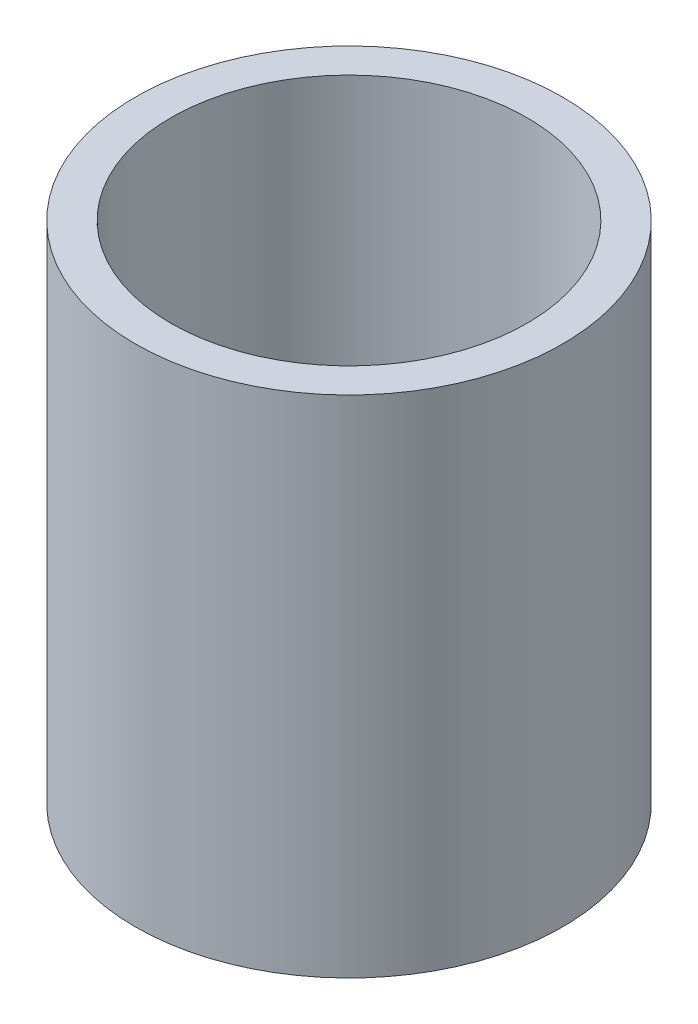
ISO-10303-21;
HEADER;
FILE_DESCRIPTION(('STEP AP214'),'2;1');
FILE_NAME('part.step','',(''),(''),'','','');
FILE_SCHEMA(('AUTOMOTIVE_DESIGN { 1 0 10303 214 1 1 1 1 }'));
ENDSEC;
DATA;
#1=APPLICATION_CONTEXT('core data for automotive mechanical design processes');
#2=APPLICATION_PROTOCOL_DEFINITION('international standard','automotive_design',2000,#1);
#3=PRODUCT_CONTEXT('',#1,'mechanical');
#4=PRODUCT('Part','Part','',(#3));
#5=PRODUCT_RELATED_PRODUCT_CATEGORY('part','',(#4));
#6=PRODUCT_DEFINITION_FORMATION('','',#4);
#7=PRODUCT_DEFINITION_CONTEXT('part definition',#1,'design');
#8=PRODUCT_DEFINITION('design','',#6,#7);
#9=PRODUCT_DEFINITION_SHAPE('','',#8);
#10=(LENGTH_UNIT() NAMED_UNIT(*) SI_UNIT(.MILLI.,.METRE.));
#11=(NAMED_UNIT(*) PLANE_ANGLE_UNIT() SI_UNIT($,.RADIAN.));
#12=(NAMED_UNIT(*) SI_UNIT($,.STERADIAN.) SOLID_ANGLE_UNIT());
#13=UNCERTAINTY_MEASURE_WITH_UNIT(LENGTH_MEASURE(1.E-05),#10,'distance_accuracy_value','');
#14=(GEOMETRIC_REPRESENTATION_CONTEXT(3) GLOBAL_UNCERTAINTY_ASSIGNED_CONTEXT((#13)) GLOBAL_UNIT_ASSIGNED_CONTEXT((#10,
#11,#12)) REPRESENTATION_CONTEXT('',''));
#15=CARTESIAN_POINT('',(0.,0.,0.));
#16=DIRECTION('',(0.,0.,1.));
#17=DIRECTION('',(1.,0.,0.));
#18=AXIS2_PLACEMENT_3D('',#15,#16,#17);
#19=CARTESIAN_POINT('',(0.,90.,0.));
#20=DIRECTION('',(0.,-1.,0.));
#21=DIRECTION('',(0.,0.,-1.));
#22=AXIS2_PLACEMENT_3D('',#19,#20,#21);
#23=CYLINDRICAL_SURFACE('',#22,38.1);
#24=CARTESIAN_POINT('',(0.,90.,0.));
#25=DIRECTION('',(0.,1.,0.));
#26=DIRECTION('',(0.,0.,1.));
#27=AXIS2_PLACEMENT_3D('',#24,#25,#26);
#28=CIRCLE('',#27,38.1);
#29=CARTESIAN_POINT('',(0.,90.,38.1));
#30=VERTEX_POINT('',#29);
#31=EDGE_CURVE('E10',#30,#30,#28,.T.);
#32=ORIENTED_EDGE('',*,*,#31,.F.);
#33=EDGE_LOOP('',(#32));
#34=FACE_BOUND('',#33,.T.);
#35=CARTESIAN_POINT('',(0.,0.,0.));
#36=DIRECTION('',(0.,1.,0.));
#37=DIRECTION('',(0.,0.,1.));
#38=AXIS2_PLACEMENT_3D('',#35,#36,#37);
#39=CIRCLE('',#38,38.1);
#40=CARTESIAN_POINT('',(0.,0.,38.1));
#41=VERTEX_POINT('',#40);
#42=EDGE_CURVE('E34',#41,#41,#39,.T.);
#43=ORIENTED_EDGE('',*,*,#42,.T.);
#44=EDGE_LOOP('',(#43));
#45=FACE_BOUND('',#44,.T.);
#46=ADVANCED_FACE('F31',(#34,#45),#23,.T.);
#47=CARTESIAN_POINT('',(0.,90.,0.));
#48=DIRECTION('',(0.,1.,0.));
#49=DIRECTION('',(0.,0.,1.));
#50=AXIS2_PLACEMENT_3D('',#47,#48,#49);
#51=PLANE('',#50);
#52=CARTESIAN_POINT('',(0.,90.,0.));
#53=DIRECTION('',(0.,1.,0.));
#54=DIRECTION('',(0.,0.,1.));
#55=AXIS2_PLACEMENT_3D('',#52,#53,#54);
#56=CIRCLE('',#55,31.75);
#57=CARTESIAN_POINT('',(0.,90.,31.75));
#58=VERTEX_POINT('',#57);
#59=EDGE_CURVE('E43',#58,#58,#56,.T.);
#60=ORIENTED_EDGE('',*,*,#59,.F.);
#61=EDGE_LOOP('',(#60));
#62=FACE_BOUND('',#61,.T.);
#63=ORIENTED_EDGE('',*,*,#31,.T.);
#64=EDGE_LOOP('',(#63));
#65=FACE_BOUND('',#64,.T.);
#66=ADVANCED_FACE('F58',(#62,#65),#51,.T.);
#67=CARTESIAN_POINT('',(0.,0.,0.));
#68=DIRECTION('',(0.,1.,0.));
#69=DIRECTION('',(0.,0.,1.));
#70=AXIS2_PLACEMENT_3D('',#67,#68,#69);
#71=PLANE('',#70);
#72=ORIENTED_EDGE('',*,*,#42,.F.);
#73=EDGE_LOOP('',(#72));
#74=FACE_BOUND('',#73,.T.);
#75=ADVANCED_FACE('F54',(#74),#71,.F.);
#76=CARTESIAN_POINT('',(0.,12.699999914,0.));
#77=DIRECTION('',(0.,1.,0.));
#78=DIRECTION('',(0.,0.,1.));
#79=AXIS2_PLACEMENT_3D('',#76,#77,#78);
#80=CYLINDRICAL_SURFACE('',#79,31.75);
#81=CARTESIAN_POINT('',(0.,12.699999914,0.));
#82=DIRECTION('',(0.,1.,0.));
#83=DIRECTION('',(0.,0.,1.));
#84=AXIS2_PLACEMENT_3D('',#81,#82,#83);
#85=CIRCLE('',#84,31.75);
#86=CARTESIAN_POINT('',(0.,12.699999914,31.75));
#87=VERTEX_POINT('',#86);
#88=EDGE_CURVE('E41',#87,#87,#85,.T.);
#89=ORIENTED_EDGE('',*,*,#88,.F.);
#90=EDGE_LOOP('',(#89));
#91=FACE_BOUND('',#90,.T.);
#92=ORIENTED_EDGE('',*,*,#59,.T.);
#93=EDGE_LOOP('',(#92));
#94=FACE_BOUND('',#93,.T.);
#95=ADVANCED_FACE('F51',(#91,#94),#80,.F.);
#96=CARTESIAN_POINT('',(0.,12.699999914,0.));
#97=DIRECTION('',(0.,1.,0.));
#98=DIRECTION('',(0.,0.,1.));
#99=AXIS2_PLACEMENT_3D('',#96,#97,#98);
#100=PLANE('',#99);
#101=ORIENTED_EDGE('',*,*,#88,.T.);
#102=EDGE_LOOP('',(#101));
#103=FACE_BOUND('',#102,.T.);
#104=ADVANCED_FACE('F49',(#103),#100,.T.);
#105=CLOSED_SHELL('',(#46,#66,#75,#95,#104));
#106=MANIFOLD_SOLID_BREP('B2',#105);
#107=ADVANCED_BREP_SHAPE_REPRESENTATION('',(#18,#106),#14);
#108=SHAPE_DEFINITION_REPRESENTATION(#9,#107);
ENDSEC;
END-ISO-10303-21;
